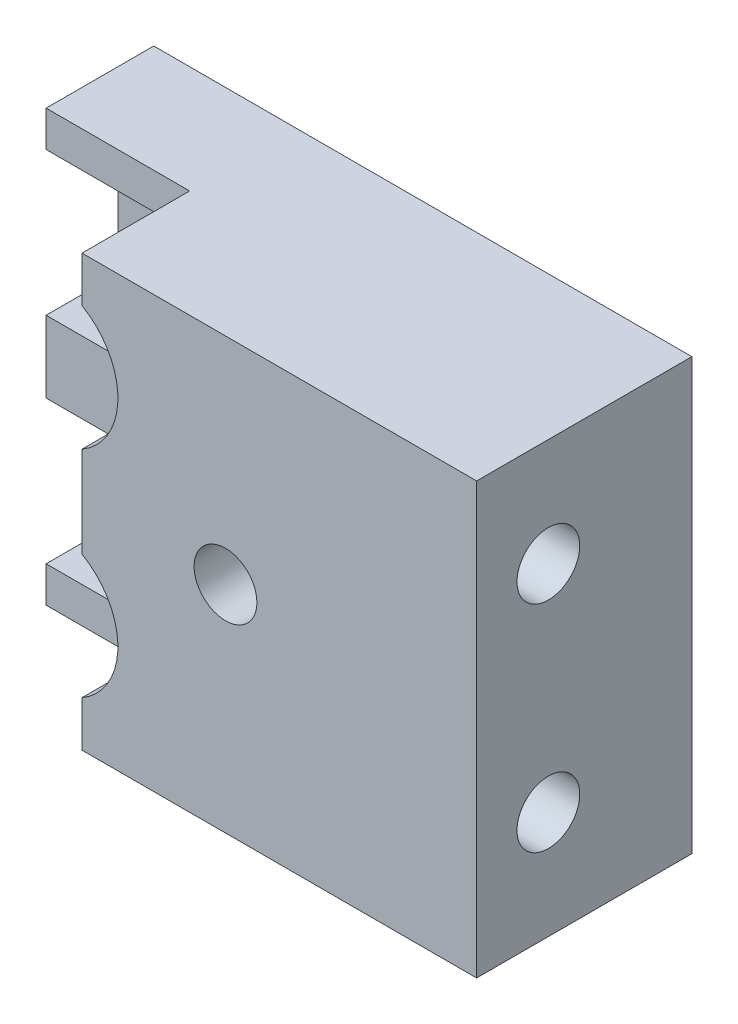
ISO-10303-21;
HEADER;
FILE_DESCRIPTION(('STEP AP214'),'2;1');
FILE_NAME('part.step','',(''),(''),'','','');
FILE_SCHEMA(('AUTOMOTIVE_DESIGN { 1 0 10303 214 1 1 1 1 }'));
ENDSEC;
DATA;
#1=APPLICATION_CONTEXT('core data for automotive mechanical design processes');
#2=APPLICATION_PROTOCOL_DEFINITION('international standard','automotive_design',2000,#1);
#3=PRODUCT_CONTEXT('',#1,'mechanical');
#4=PRODUCT('Part','Part','',(#3));
#5=PRODUCT_RELATED_PRODUCT_CATEGORY('part','',(#4));
#6=PRODUCT_DEFINITION_FORMATION('','',#4);
#7=PRODUCT_DEFINITION_CONTEXT('part definition',#1,'design');
#8=PRODUCT_DEFINITION('design','',#6,#7);
#9=PRODUCT_DEFINITION_SHAPE('','',#8);
#10=(LENGTH_UNIT() NAMED_UNIT(*) SI_UNIT(.MILLI.,.METRE.));
#11=(NAMED_UNIT(*) PLANE_ANGLE_UNIT() SI_UNIT($,.RADIAN.));
#12=(NAMED_UNIT(*) SI_UNIT($,.STERADIAN.) SOLID_ANGLE_UNIT());
#13=UNCERTAINTY_MEASURE_WITH_UNIT(LENGTH_MEASURE(1.E-05),#10,'distance_accuracy_value','');
#14=(GEOMETRIC_REPRESENTATION_CONTEXT(3) GLOBAL_UNCERTAINTY_ASSIGNED_CONTEXT((#13)) GLOBAL_UNIT_ASSIGNED_CONTEXT((#10,
#11,#12)) REPRESENTATION_CONTEXT('',''));
#15=CARTESIAN_POINT('',(0.,0.,0.));
#16=DIRECTION('',(0.,0.,1.));
#17=DIRECTION('',(1.,0.,0.));
#18=AXIS2_PLACEMENT_3D('',#15,#16,#17);
#19=CARTESIAN_POINT('',(0.,0.,60.));
#20=DIRECTION('',(1.,0.,0.));
#21=DIRECTION('',(0.,0.,-1.));
#22=AXIS2_PLACEMENT_3D('',#19,#20,#21);
#23=PLANE('',#22);
#24=DIRECTION('',(0.,-1.,0.));
#25=VECTOR('',#24,1.);
#26=CARTESIAN_POINT('',(0.,0.,30.));
#27=LINE('',#26,#25);
#28=CARTESIAN_POINT('',(0.,10.,30.));
#29=VERTEX_POINT('',#28);
#30=CARTESIAN_POINT('',(0.,0.,30.));
#31=VERTEX_POINT('',#30);
#32=EDGE_CURVE('E227',#29,#31,#27,.T.);
#33=ORIENTED_EDGE('',*,*,#32,.F.);
#34=DIRECTION('',(0.,0.,1.));
#35=VECTOR('',#34,1.);
#36=CARTESIAN_POINT('',(0.,10.,0.));
#37=LINE('',#36,#35);
#38=CARTESIAN_POINT('',(0.,10.,0.));
#39=VERTEX_POINT('',#38);
#40=EDGE_CURVE('E332',#39,#29,#37,.T.);
#41=ORIENTED_EDGE('',*,*,#40,.F.);
#42=DIRECTION('',(0.,-1.,0.));
#43=VECTOR('',#42,1.);
#44=CARTESIAN_POINT('',(0.,0.,0.));
#45=LINE('',#44,#43);
#46=CARTESIAN_POINT('',(0.,0.,0.));
#47=VERTEX_POINT('',#46);
#48=EDGE_CURVE('E357',#39,#47,#45,.T.);
#49=ORIENTED_EDGE('',*,*,#48,.T.);
#50=DIRECTION('',(0.,0.,-1.));
#51=VECTOR('',#50,1.);
#52=CARTESIAN_POINT('',(0.,0.,60.));
#53=LINE('',#52,#51);
#54=EDGE_CURVE('E11',#31,#47,#53,.T.);
#55=ORIENTED_EDGE('',*,*,#54,.F.);
#56=EDGE_LOOP('',(#33,#41,#49,#55));
#57=FACE_BOUND('',#56,.T.);
#58=ADVANCED_FACE('F35',(#57),#23,.F.);
#59=CARTESIAN_POINT('',(0.,10.,0.));
#60=DIRECTION('',(0.,-1.,0.));
#61=DIRECTION('',(0.,0.,-1.));
#62=AXIS2_PLACEMENT_3D('',#59,#60,#61);
#63=PLANE('',#62);
#64=DIRECTION('',(-1.,0.,0.));
#65=VECTOR('',#64,1.);
#66=CARTESIAN_POINT('',(0.,10.,30.));
#67=LINE('',#66,#65);
#68=CARTESIAN_POINT('',(30.,10.,30.));
#69=VERTEX_POINT('',#68);
#70=EDGE_CURVE('E225',#69,#29,#67,.T.);
#71=ORIENTED_EDGE('',*,*,#70,.F.);
#72=DIRECTION('',(0.,0.,1.));
#73=VECTOR('',#72,1.);
#74=CARTESIAN_POINT('',(30.,10.,20.));
#75=LINE('',#74,#73);
#76=CARTESIAN_POINT('',(30.,10.,20.));
#77=VERTEX_POINT('',#76);
#78=EDGE_CURVE('E298',#77,#69,#75,.T.);
#79=ORIENTED_EDGE('',*,*,#78,.F.);
#80=DIRECTION('',(1.,0.,0.));
#81=VECTOR('',#80,1.);
#82=CARTESIAN_POINT('',(10.,10.,20.));
#83=LINE('',#82,#81);
#84=CARTESIAN_POINT('',(10.,10.,20.));
#85=VERTEX_POINT('',#84);
#86=EDGE_CURVE('E292',#85,#77,#83,.T.);
#87=ORIENTED_EDGE('',*,*,#86,.F.);
#88=DIRECTION('',(0.,0.,1.));
#89=VECTOR('',#88,1.);
#90=CARTESIAN_POINT('',(10.,10.,0.));
#91=LINE('',#90,#89);
#92=CARTESIAN_POINT('',(10.,10.,0.));
#93=VERTEX_POINT('',#92);
#94=EDGE_CURVE('E340',#93,#85,#91,.T.);
#95=ORIENTED_EDGE('',*,*,#94,.F.);
#96=DIRECTION('',(1.,0.,0.));
#97=VECTOR('',#96,1.);
#98=CARTESIAN_POINT('',(0.,10.,0.));
#99=LINE('',#98,#97);
#100=EDGE_CURVE('E321',#39,#93,#99,.T.);
#101=ORIENTED_EDGE('',*,*,#100,.F.);
#102=ORIENTED_EDGE('',*,*,#40,.T.);
#103=EDGE_LOOP('',(#71,#79,#87,#95,#101,#102));
#104=FACE_BOUND('',#103,.T.);
#105=ADVANCED_FACE('F426',(#104),#63,.F.);
#106=DIRECTION('',(0.,-1.,0.));
#107=VECTOR('',#106,1.);
#108=CARTESIAN_POINT('',(0.,0.,30.));
#109=LINE('',#108,#107);
#110=CARTESIAN_POINT('',(0.,70.,30.));
#111=VERTEX_POINT('',#110);
#112=CARTESIAN_POINT('',(0.,50.,30.));
#113=VERTEX_POINT('',#112);
#114=EDGE_CURVE('E242',#111,#113,#109,.T.);
#115=ORIENTED_EDGE('',*,*,#114,.F.);
#116=DIRECTION('',(0.,0.,1.));
#117=VECTOR('',#116,1.);
#118=CARTESIAN_POINT('',(0.,70.,0.));
#119=LINE('',#118,#117);
#120=CARTESIAN_POINT('',(0.,70.,0.));
#121=VERTEX_POINT('',#120);
#122=EDGE_CURVE('E353',#121,#111,#119,.T.);
#123=ORIENTED_EDGE('',*,*,#122,.F.);
#124=CARTESIAN_POINT('',(0.,50.,0.));
#125=VERTEX_POINT('',#124);
#126=EDGE_CURVE('E379',#121,#125,#45,.T.);
#127=ORIENTED_EDGE('',*,*,#126,.T.);
#128=DIRECTION('',(0.,0.,1.));
#129=VECTOR('',#128,1.);
#130=CARTESIAN_POINT('',(0.,50.,0.));
#131=LINE('',#130,#129);
#132=EDGE_CURVE('E333',#125,#113,#131,.T.);
#133=ORIENTED_EDGE('',*,*,#132,.T.);
#134=EDGE_LOOP('',(#115,#123,#127,#133));
#135=FACE_BOUND('',#134,.T.);
#136=ADVANCED_FACE('F434',(#135),#23,.F.);
#137=CARTESIAN_POINT('',(0.,0.,60.));
#138=DIRECTION('',(0.,0.,-1.));
#139=DIRECTION('',(-1.,0.,0.));
#140=AXIS2_PLACEMENT_3D('',#137,#138,#139);
#141=PLANE('',#140);
#142=CARTESIAN_POINT('',(80.,60.,60.));
#143=DIRECTION('',(0.,0.,1.));
#144=DIRECTION('',(1.,0.,0.));
#145=AXIS2_PLACEMENT_3D('',#142,#143,#144);
#146=CIRCLE('',#145,8.74999999999999);
#147=CARTESIAN_POINT('',(88.75,60.,60.));
#148=VERTEX_POINT('',#147);
#149=EDGE_CURVE('E212',#148,#148,#146,.T.);
#150=ORIENTED_EDGE('',*,*,#149,.F.);
#151=EDGE_LOOP('',(#150));
#152=FACE_BOUND('',#151,.T.);
#153=CARTESIAN_POINT('',(30.,30.,60.));
#154=DIRECTION('',(0.,0.,1.));
#155=DIRECTION('',(-1.,0.,0.));
#156=AXIS2_PLACEMENT_3D('',#153,#154,#155);
#157=CIRCLE('',#156,20.);
#158=CARTESIAN_POINT('',(40.,12.6794919243112,60.));
#159=VERTEX_POINT('',#158);
#160=CARTESIAN_POINT('',(40.,47.3205080756888,60.));
#161=VERTEX_POINT('',#160);
#162=EDGE_CURVE('E287',#159,#161,#157,.T.);
#163=ORIENTED_EDGE('',*,*,#162,.F.);
#164=DIRECTION('',(0.,1.,0.));
#165=VECTOR('',#164,1.);
#166=CARTESIAN_POINT('',(40.,0.,60.));
#167=LINE('',#166,#165);
#168=CARTESIAN_POINT('',(40.,0.,60.));
#169=VERTEX_POINT('',#168);
#170=EDGE_CURVE('E218',#169,#159,#167,.T.);
#171=ORIENTED_EDGE('',*,*,#170,.F.);
#172=DIRECTION('',(1.,0.,0.));
#173=VECTOR('',#172,1.);
#174=CARTESIAN_POINT('',(0.,0.,60.));
#175=LINE('',#174,#173);
#176=CARTESIAN_POINT('',(150.,0.,60.));
#177=VERTEX_POINT('',#176);
#178=EDGE_CURVE('E366',#169,#177,#175,.T.);
#179=ORIENTED_EDGE('',*,*,#178,.T.);
#180=DIRECTION('',(0.,1.,0.));
#181=VECTOR('',#180,1.);
#182=CARTESIAN_POINT('',(150.,0.,60.));
#183=LINE('',#182,#181);
#184=CARTESIAN_POINT('',(150.,120.,60.));
#185=VERTEX_POINT('',#184);
#186=EDGE_CURVE('E368',#177,#185,#183,.T.);
#187=ORIENTED_EDGE('',*,*,#186,.T.);
#188=DIRECTION('',(-1.,0.,0.));
#189=VECTOR('',#188,1.);
#190=CARTESIAN_POINT('',(0.,120.,60.));
#191=LINE('',#190,#189);
#192=CARTESIAN_POINT('',(40.,120.,60.));
#193=VERTEX_POINT('',#192);
#194=EDGE_CURVE('E371',#185,#193,#191,.T.);
#195=ORIENTED_EDGE('',*,*,#194,.T.);
#196=DIRECTION('',(0.,1.,0.));
#197=VECTOR('',#196,1.);
#198=CARTESIAN_POINT('',(40.,0.,60.));
#199=LINE('',#198,#197);
#200=CARTESIAN_POINT('',(40.,107.320508075689,60.));
#201=VERTEX_POINT('',#200);
#202=EDGE_CURVE('E253',#201,#193,#199,.T.);
#203=ORIENTED_EDGE('',*,*,#202,.F.);
#204=CARTESIAN_POINT('',(30.,90.,60.));
#205=DIRECTION('',(0.,0.,1.));
#206=DIRECTION('',(-1.,0.,0.));
#207=AXIS2_PLACEMENT_3D('',#204,#205,#206);
#208=CIRCLE('',#207,20.);
#209=CARTESIAN_POINT('',(40.,72.6794919243112,60.));
#210=VERTEX_POINT('',#209);
#211=EDGE_CURVE('E303',#210,#201,#208,.T.);
#212=ORIENTED_EDGE('',*,*,#211,.F.);
#213=DIRECTION('',(0.,-1.,0.));
#214=VECTOR('',#213,1.);
#215=CARTESIAN_POINT('',(40.,0.,60.));
#216=LINE('',#215,#214);
#217=EDGE_CURVE('E234',#210,#161,#216,.T.);
#218=ORIENTED_EDGE('',*,*,#217,.T.);
#219=EDGE_LOOP('',(#163,#171,#179,#187,#195,#203,#212,#218));
#220=FACE_BOUND('',#219,.T.);
#221=ADVANCED_FACE('F411',(#152,#220),#141,.F.);
#222=CARTESIAN_POINT('',(0.,70.,0.));
#223=DIRECTION('',(0.,-1.,0.));
#224=DIRECTION('',(0.,0.,-1.));
#225=AXIS2_PLACEMENT_3D('',#222,#223,#224);
#226=PLANE('',#225);
#227=DIRECTION('',(-1.,0.,0.));
#228=VECTOR('',#227,1.);
#229=CARTESIAN_POINT('',(0.,70.,30.));
#230=LINE('',#229,#228);
#231=CARTESIAN_POINT('',(30.,70.,30.));
#232=VERTEX_POINT('',#231);
#233=EDGE_CURVE('E240',#232,#111,#230,.T.);
#234=ORIENTED_EDGE('',*,*,#233,.F.);
#235=DIRECTION('',(0.,0.,1.));
#236=VECTOR('',#235,1.);
#237=CARTESIAN_POINT('',(30.,70.,20.));
#238=LINE('',#237,#236);
#239=CARTESIAN_POINT('',(30.,70.,20.));
#240=VERTEX_POINT('',#239);
#241=EDGE_CURVE('E316',#240,#232,#238,.T.);
#242=ORIENTED_EDGE('',*,*,#241,.F.);
#243=DIRECTION('',(1.,0.,0.));
#244=VECTOR('',#243,1.);
#245=CARTESIAN_POINT('',(10.,70.,20.));
#246=LINE('',#245,#244);
#247=CARTESIAN_POINT('',(10.,70.,20.));
#248=VERTEX_POINT('',#247);
#249=EDGE_CURVE('E308',#248,#240,#246,.T.);
#250=ORIENTED_EDGE('',*,*,#249,.F.);
#251=DIRECTION('',(0.,0.,1.));
#252=VECTOR('',#251,1.);
#253=CARTESIAN_POINT('',(10.,70.,0.));
#254=LINE('',#253,#252);
#255=CARTESIAN_POINT('',(10.,70.,0.));
#256=VERTEX_POINT('',#255);
#257=EDGE_CURVE('E361',#256,#248,#254,.T.);
#258=ORIENTED_EDGE('',*,*,#257,.F.);
#259=DIRECTION('',(1.,0.,0.));
#260=VECTOR('',#259,1.);
#261=CARTESIAN_POINT('',(0.,70.,0.));
#262=LINE('',#261,#260);
#263=EDGE_CURVE('E336',#121,#256,#262,.T.);
#264=ORIENTED_EDGE('',*,*,#263,.F.);
#265=ORIENTED_EDGE('',*,*,#122,.T.);
#266=EDGE_LOOP('',(#234,#242,#250,#258,#264,#265));
#267=FACE_BOUND('',#266,.T.);
#268=ADVANCED_FACE('F453',(#267),#226,.F.);
#269=CARTESIAN_POINT('',(0.,50.,0.));
#270=DIRECTION('',(0.,1.,0.));
#271=DIRECTION('',(0.,0.,1.));
#272=AXIS2_PLACEMENT_3D('',#269,#270,#271);
#273=PLANE('',#272);
#274=DIRECTION('',(1.,0.,0.));
#275=VECTOR('',#274,1.);
#276=CARTESIAN_POINT('',(0.,50.,30.));
#277=LINE('',#276,#275);
#278=CARTESIAN_POINT('',(30.,50.,30.));
#279=VERTEX_POINT('',#278);
#280=EDGE_CURVE('E57',#113,#279,#277,.T.);
#281=ORIENTED_EDGE('',*,*,#280,.F.);
#282=ORIENTED_EDGE('',*,*,#132,.F.);
#283=DIRECTION('',(-1.,0.,0.));
#284=VECTOR('',#283,1.);
#285=CARTESIAN_POINT('',(0.,50.,0.));
#286=LINE('',#285,#284);
#287=CARTESIAN_POINT('',(10.,50.,0.));
#288=VERTEX_POINT('',#287);
#289=EDGE_CURVE('E329',#288,#125,#286,.T.);
#290=ORIENTED_EDGE('',*,*,#289,.F.);
#291=DIRECTION('',(0.,0.,1.));
#292=VECTOR('',#291,1.);
#293=CARTESIAN_POINT('',(10.,50.,0.));
#294=LINE('',#293,#292);
#295=CARTESIAN_POINT('',(10.,50.,20.));
#296=VERTEX_POINT('',#295);
#297=EDGE_CURVE('E337',#288,#296,#294,.T.);
#298=ORIENTED_EDGE('',*,*,#297,.T.);
#299=DIRECTION('',(-1.,0.,0.));
#300=VECTOR('',#299,1.);
#301=CARTESIAN_POINT('',(10.,50.,20.));
#302=LINE('',#301,#300);
#303=CARTESIAN_POINT('',(30.,50.,20.));
#304=VERTEX_POINT('',#303);
#305=EDGE_CURVE('E288',#304,#296,#302,.T.);
#306=ORIENTED_EDGE('',*,*,#305,.F.);
#307=DIRECTION('',(0.,0.,1.));
#308=VECTOR('',#307,1.);
#309=CARTESIAN_POINT('',(30.,50.,20.));
#310=LINE('',#309,#308);
#311=EDGE_CURVE('E300',#304,#279,#310,.T.);
#312=ORIENTED_EDGE('',*,*,#311,.T.);
#313=EDGE_LOOP('',(#281,#282,#290,#298,#306,#312));
#314=FACE_BOUND('',#313,.T.);
#315=ADVANCED_FACE('F437',(#314),#273,.F.);
#316=CARTESIAN_POINT('',(30.,90.,20.));
#317=DIRECTION('',(0.,0.,1.));
#318=DIRECTION('',(1.,0.,0.));
#319=AXIS2_PLACEMENT_3D('',#316,#317,#318);
#320=CYLINDRICAL_SURFACE('',#319,20.);
#321=DIRECTION('',(0.,0.,1.));
#322=VECTOR('',#321,1.);
#323=CARTESIAN_POINT('',(40.,72.6794919243112,30.));
#324=LINE('',#323,#322);
#325=CARTESIAN_POINT('',(40.,72.6794919243112,30.));
#326=VERTEX_POINT('',#325);
#327=EDGE_CURVE('E247',#326,#210,#324,.T.);
#328=ORIENTED_EDGE('',*,*,#327,.T.);
#329=ORIENTED_EDGE('',*,*,#211,.T.);
#330=DIRECTION('',(0.,0.,1.));
#331=VECTOR('',#330,1.);
#332=CARTESIAN_POINT('',(40.,107.320508075689,30.));
#333=LINE('',#332,#331);
#334=CARTESIAN_POINT('',(40.,107.320508075689,30.));
#335=VERTEX_POINT('',#334);
#336=EDGE_CURVE('E268',#335,#201,#333,.T.);
#337=ORIENTED_EDGE('',*,*,#336,.F.);
#338=CARTESIAN_POINT('',(30.,90.,30.));
#339=DIRECTION('',(0.,0.,1.));
#340=DIRECTION('',(1.,0.,0.));
#341=AXIS2_PLACEMENT_3D('',#338,#339,#340);
#342=CIRCLE('',#341,20.);
#343=CARTESIAN_POINT('',(30.,110.,30.));
#344=VERTEX_POINT('',#343);
#345=EDGE_CURVE('E256',#344,#335,#342,.F.);
#346=ORIENTED_EDGE('',*,*,#345,.F.);
#347=DIRECTION('',(0.,0.,1.));
#348=VECTOR('',#347,1.);
#349=CARTESIAN_POINT('',(30.,110.,20.));
#350=LINE('',#349,#348);
#351=CARTESIAN_POINT('',(30.,110.,20.));
#352=VERTEX_POINT('',#351);
#353=EDGE_CURVE('E318',#352,#344,#350,.T.);
#354=ORIENTED_EDGE('',*,*,#353,.F.);
#355=CARTESIAN_POINT('',(30.,90.,20.));
#356=DIRECTION('',(0.,0.,1.));
#357=DIRECTION('',(-1.,0.,0.));
#358=AXIS2_PLACEMENT_3D('',#355,#356,#357);
#359=CIRCLE('',#358,20.);
#360=EDGE_CURVE('E311',#240,#352,#359,.T.);
#361=ORIENTED_EDGE('',*,*,#360,.F.);
#362=ORIENTED_EDGE('',*,*,#241,.T.);
#363=CARTESIAN_POINT('',(30.,90.,30.));
#364=DIRECTION('',(0.,0.,1.));
#365=DIRECTION('',(1.,0.,0.));
#366=AXIS2_PLACEMENT_3D('',#363,#364,#365);
#367=CIRCLE('',#366,20.);
#368=EDGE_CURVE('E238',#326,#232,#367,.F.);
#369=ORIENTED_EDGE('',*,*,#368,.F.);
#370=EDGE_LOOP('',(#328,#329,#337,#346,#354,#361,#362,#369));
#371=FACE_BOUND('',#370,.T.);
#372=ADVANCED_FACE('F449',(#371),#320,.F.);
#373=CARTESIAN_POINT('',(30.,30.,20.));
#374=DIRECTION('',(0.,0.,1.));
#375=DIRECTION('',(1.,0.,0.));
#376=AXIS2_PLACEMENT_3D('',#373,#374,#375);
#377=CYLINDRICAL_SURFACE('',#376,20.);
#378=CARTESIAN_POINT('',(30.,30.,30.));
#379=DIRECTION('',(0.,0.,1.));
#380=DIRECTION('',(1.,0.,0.));
#381=AXIS2_PLACEMENT_3D('',#378,#379,#380);
#382=CIRCLE('',#381,20.);
#383=CARTESIAN_POINT('',(40.,12.6794919243112,30.));
#384=VERTEX_POINT('',#383);
#385=EDGE_CURVE('E49',#384,#69,#382,.F.);
#386=ORIENTED_EDGE('',*,*,#385,.F.);
#387=DIRECTION('',(0.,0.,1.));
#388=VECTOR('',#387,1.);
#389=CARTESIAN_POINT('',(40.,12.6794919243112,30.));
#390=LINE('',#389,#388);
#391=EDGE_CURVE('E231',#384,#159,#390,.T.);
#392=ORIENTED_EDGE('',*,*,#391,.T.);
#393=ORIENTED_EDGE('',*,*,#162,.T.);
#394=DIRECTION('',(0.,0.,1.));
#395=VECTOR('',#394,1.);
#396=CARTESIAN_POINT('',(40.,47.3205080756888,30.));
#397=LINE('',#396,#395);
#398=CARTESIAN_POINT('',(40.,47.3205080756888,30.));
#399=VERTEX_POINT('',#398);
#400=EDGE_CURVE('E250',#399,#161,#397,.T.);
#401=ORIENTED_EDGE('',*,*,#400,.F.);
#402=CARTESIAN_POINT('',(30.,30.,30.));
#403=DIRECTION('',(0.,0.,1.));
#404=DIRECTION('',(1.,0.,0.));
#405=AXIS2_PLACEMENT_3D('',#402,#403,#404);
#406=CIRCLE('',#405,20.);
#407=EDGE_CURVE('E245',#279,#399,#406,.F.);
#408=ORIENTED_EDGE('',*,*,#407,.F.);
#409=ORIENTED_EDGE('',*,*,#311,.F.);
#410=CARTESIAN_POINT('',(30.,30.,20.));
#411=DIRECTION('',(0.,0.,1.));
#412=DIRECTION('',(-1.,0.,0.));
#413=AXIS2_PLACEMENT_3D('',#410,#411,#412);
#414=CIRCLE('',#413,20.);
#415=EDGE_CURVE('E295',#77,#304,#414,.T.);
#416=ORIENTED_EDGE('',*,*,#415,.F.);
#417=ORIENTED_EDGE('',*,*,#78,.T.);
#418=EDGE_LOOP('',(#386,#392,#393,#401,#408,#409,#416,#417));
#419=FACE_BOUND('',#418,.T.);
#420=ADVANCED_FACE('F441',(#419),#377,.F.);
#421=DIRECTION('',(0.,-1.,0.));
#422=VECTOR('',#421,1.);
#423=CARTESIAN_POINT('',(0.,0.,30.));
#424=LINE('',#423,#422);
#425=CARTESIAN_POINT('',(0.,120.,30.));
#426=VERTEX_POINT('',#425);
#427=CARTESIAN_POINT('',(0.,110.,30.));
#428=VERTEX_POINT('',#427);
#429=EDGE_CURVE('E264',#426,#428,#424,.T.);
#430=ORIENTED_EDGE('',*,*,#429,.F.);
#431=DIRECTION('',(0.,0.,-1.));
#432=VECTOR('',#431,1.);
#433=CARTESIAN_POINT('',(0.,120.,60.));
#434=LINE('',#433,#432);
#435=CARTESIAN_POINT('',(0.,120.,0.));
#436=VERTEX_POINT('',#435);
#437=EDGE_CURVE('E374',#426,#436,#434,.T.);
#438=ORIENTED_EDGE('',*,*,#437,.T.);
#439=CARTESIAN_POINT('',(0.,110.,0.));
#440=VERTEX_POINT('',#439);
#441=EDGE_CURVE('E375',#436,#440,#45,.T.);
#442=ORIENTED_EDGE('',*,*,#441,.T.);
#443=DIRECTION('',(0.,0.,1.));
#444=VECTOR('',#443,1.);
#445=CARTESIAN_POINT('',(0.,110.,0.));
#446=LINE('',#445,#444);
#447=EDGE_CURVE('E354',#440,#428,#446,.T.);
#448=ORIENTED_EDGE('',*,*,#447,.T.);
#449=EDGE_LOOP('',(#430,#438,#442,#448));
#450=FACE_BOUND('',#449,.T.);
#451=ADVANCED_FACE('F462',(#450),#23,.F.);
#452=CARTESIAN_POINT('',(0.,110.,0.));
#453=DIRECTION('',(0.,1.,0.));
#454=DIRECTION('',(0.,0.,1.));
#455=AXIS2_PLACEMENT_3D('',#452,#453,#454);
#456=PLANE('',#455);
#457=DIRECTION('',(1.,0.,0.));
#458=VECTOR('',#457,1.);
#459=CARTESIAN_POINT('',(0.,110.,30.));
#460=LINE('',#459,#458);
#461=EDGE_CURVE('E266',#428,#344,#460,.T.);
#462=ORIENTED_EDGE('',*,*,#461,.F.);
#463=ORIENTED_EDGE('',*,*,#447,.F.);
#464=DIRECTION('',(-1.,0.,0.));
#465=VECTOR('',#464,1.);
#466=CARTESIAN_POINT('',(0.,110.,0.));
#467=LINE('',#466,#465);
#468=CARTESIAN_POINT('',(10.,110.,0.));
#469=VERTEX_POINT('',#468);
#470=EDGE_CURVE('E350',#469,#440,#467,.T.);
#471=ORIENTED_EDGE('',*,*,#470,.F.);
#472=DIRECTION('',(0.,0.,1.));
#473=VECTOR('',#472,1.);
#474=CARTESIAN_POINT('',(10.,110.,0.));
#475=LINE('',#474,#473);
#476=CARTESIAN_POINT('',(10.,110.,20.));
#477=VERTEX_POINT('',#476);
#478=EDGE_CURVE('E358',#469,#477,#475,.T.);
#479=ORIENTED_EDGE('',*,*,#478,.T.);
#480=DIRECTION('',(-1.,0.,0.));
#481=VECTOR('',#480,1.);
#482=CARTESIAN_POINT('',(10.,110.,20.));
#483=LINE('',#482,#481);
#484=EDGE_CURVE('E314',#352,#477,#483,.T.);
#485=ORIENTED_EDGE('',*,*,#484,.F.);
#486=ORIENTED_EDGE('',*,*,#353,.T.);
#487=EDGE_LOOP('',(#462,#463,#471,#479,#485,#486));
#488=FACE_BOUND('',#487,.T.);
#489=ADVANCED_FACE('F467',(#488),#456,.F.);
#490=CARTESIAN_POINT('',(0.,0.,60.));
#491=DIRECTION('',(0.,1.,0.));
#492=DIRECTION('',(0.,0.,1.));
#493=AXIS2_PLACEMENT_3D('',#490,#491,#492);
#494=PLANE('',#493);
#495=ORIENTED_EDGE('',*,*,#178,.F.);
#496=DIRECTION('',(0.,0.,1.));
#497=VECTOR('',#496,1.);
#498=CARTESIAN_POINT('',(40.,0.,30.));
#499=LINE('',#498,#497);
#500=CARTESIAN_POINT('',(40.,0.,30.));
#501=VERTEX_POINT('',#500);
#502=EDGE_CURVE('E229',#501,#169,#499,.T.);
#503=ORIENTED_EDGE('',*,*,#502,.F.);
#504=DIRECTION('',(1.,0.,0.));
#505=VECTOR('',#504,1.);
#506=CARTESIAN_POINT('',(0.,0.,30.));
#507=LINE('',#506,#505);
#508=EDGE_CURVE('E219',#31,#501,#507,.T.);
#509=ORIENTED_EDGE('',*,*,#508,.F.);
#510=ORIENTED_EDGE('',*,*,#54,.T.);
#511=DIRECTION('',(1.,0.,0.));
#512=VECTOR('',#511,1.);
#513=CARTESIAN_POINT('',(0.,0.,0.));
#514=LINE('',#513,#512);
#515=CARTESIAN_POINT('',(150.,0.,0.));
#516=VERTEX_POINT('',#515);
#517=EDGE_CURVE('E378',#47,#516,#514,.T.);
#518=ORIENTED_EDGE('',*,*,#517,.T.);
#519=DIRECTION('',(0.,0.,-1.));
#520=VECTOR('',#519,1.);
#521=CARTESIAN_POINT('',(150.,0.,60.));
#522=LINE('',#521,#520);
#523=EDGE_CURVE('E42',#177,#516,#522,.T.);
#524=ORIENTED_EDGE('',*,*,#523,.F.);
#525=EDGE_LOOP('',(#495,#503,#509,#510,#518,#524));
#526=FACE_BOUND('',#525,.T.);
#527=ADVANCED_FACE('F415',(#526),#494,.F.);
#528=CARTESIAN_POINT('',(150.,0.,60.));
#529=DIRECTION('',(-1.,0.,0.));
#530=DIRECTION('',(0.,0.,1.));
#531=AXIS2_PLACEMENT_3D('',#528,#529,#530);
#532=PLANE('',#531);
#533=CARTESIAN_POINT('',(150.,90.,40.));
#534=DIRECTION('',(1.,0.,0.));
#535=DIRECTION('',(0.,0.,-1.));
#536=AXIS2_PLACEMENT_3D('',#533,#534,#535);
#537=CIRCLE('',#536,8.74999999999998);
#538=CARTESIAN_POINT('',(150.,90.,31.25));
#539=VERTEX_POINT('',#538);
#540=EDGE_CURVE('E202',#539,#539,#537,.T.);
#541=ORIENTED_EDGE('',*,*,#540,.F.);
#542=EDGE_LOOP('',(#541));
#543=FACE_BOUND('',#542,.T.);
#544=CARTESIAN_POINT('',(150.,30.,40.));
#545=DIRECTION('',(1.,0.,0.));
#546=DIRECTION('',(0.,0.,-1.));
#547=AXIS2_PLACEMENT_3D('',#544,#545,#546);
#548=CIRCLE('',#547,8.74999999999999);
#549=CARTESIAN_POINT('',(150.,30.,31.25));
#550=VERTEX_POINT('',#549);
#551=EDGE_CURVE('E201',#550,#550,#548,.T.);
#552=ORIENTED_EDGE('',*,*,#551,.F.);
#553=EDGE_LOOP('',(#552));
#554=FACE_BOUND('',#553,.T.);
#555=DIRECTION('',(0.,1.,0.));
#556=VECTOR('',#555,1.);
#557=CARTESIAN_POINT('',(150.,0.,0.));
#558=LINE('',#557,#556);
#559=CARTESIAN_POINT('',(150.,120.,0.));
#560=VERTEX_POINT('',#559);
#561=EDGE_CURVE('E381',#516,#560,#558,.T.);
#562=ORIENTED_EDGE('',*,*,#561,.T.);
#563=DIRECTION('',(0.,0.,-1.));
#564=VECTOR('',#563,1.);
#565=CARTESIAN_POINT('',(150.,120.,60.));
#566=LINE('',#565,#564);
#567=EDGE_CURVE('E386',#185,#560,#566,.T.);
#568=ORIENTED_EDGE('',*,*,#567,.F.);
#569=ORIENTED_EDGE('',*,*,#186,.F.);
#570=ORIENTED_EDGE('',*,*,#523,.T.);
#571=EDGE_LOOP('',(#562,#568,#569,#570));
#572=FACE_BOUND('',#571,.T.);
#573=ADVANCED_FACE('F393',(#543,#554,#572),#532,.F.);
#574=CARTESIAN_POINT('',(0.,120.,60.));
#575=DIRECTION('',(0.,-1.,0.));
#576=DIRECTION('',(0.,0.,-1.));
#577=AXIS2_PLACEMENT_3D('',#574,#575,#576);
#578=PLANE('',#577);
#579=DIRECTION('',(-1.,0.,0.));
#580=VECTOR('',#579,1.);
#581=CARTESIAN_POINT('',(0.,120.,30.));
#582=LINE('',#581,#580);
#583=CARTESIAN_POINT('',(40.,120.,30.));
#584=VERTEX_POINT('',#583);
#585=EDGE_CURVE('E262',#584,#426,#582,.T.);
#586=ORIENTED_EDGE('',*,*,#585,.F.);
#587=DIRECTION('',(0.,0.,1.));
#588=VECTOR('',#587,1.);
#589=CARTESIAN_POINT('',(40.,120.,30.));
#590=LINE('',#589,#588);
#591=EDGE_CURVE('E270',#584,#193,#590,.T.);
#592=ORIENTED_EDGE('',*,*,#591,.T.);
#593=ORIENTED_EDGE('',*,*,#194,.F.);
#594=ORIENTED_EDGE('',*,*,#567,.T.);
#595=DIRECTION('',(-1.,0.,0.));
#596=VECTOR('',#595,1.);
#597=CARTESIAN_POINT('',(0.,120.,0.));
#598=LINE('',#597,#596);
#599=EDGE_CURVE('E369',#560,#436,#598,.T.);
#600=ORIENTED_EDGE('',*,*,#599,.T.);
#601=ORIENTED_EDGE('',*,*,#437,.F.);
#602=EDGE_LOOP('',(#586,#592,#593,#594,#600,#601));
#603=FACE_BOUND('',#602,.T.);
#604=ADVANCED_FACE('F406',(#603),#578,.F.);
#605=CARTESIAN_POINT('',(0.,0.,0.));
#606=DIRECTION('',(0.,0.,-1.));
#607=DIRECTION('',(-1.,0.,0.));
#608=AXIS2_PLACEMENT_3D('',#605,#606,#607);
#609=PLANE('',#608);
#610=CARTESIAN_POINT('',(30.,90.,0.));
#611=DIRECTION('',(0.,0.,-1.));
#612=DIRECTION('',(-1.,0.,0.));
#613=AXIS2_PLACEMENT_3D('',#610,#611,#612);
#614=CIRCLE('',#613,8.74999999999998);
#615=CARTESIAN_POINT('',(21.25,90.,0.));
#616=VERTEX_POINT('',#615);
#617=EDGE_CURVE('E278',#616,#616,#614,.T.);
#618=ORIENTED_EDGE('',*,*,#617,.F.);
#619=EDGE_LOOP('',(#618));
#620=FACE_BOUND('',#619,.T.);
#621=CARTESIAN_POINT('',(30.,30.,0.));
#622=DIRECTION('',(0.,0.,-1.));
#623=DIRECTION('',(-1.,0.,0.));
#624=AXIS2_PLACEMENT_3D('',#621,#622,#623);
#625=CIRCLE('',#624,8.74999999999998);
#626=CARTESIAN_POINT('',(21.25,30.,0.));
#627=VERTEX_POINT('',#626);
#628=EDGE_CURVE('E284',#627,#627,#625,.T.);
#629=ORIENTED_EDGE('',*,*,#628,.F.);
#630=EDGE_LOOP('',(#629));
#631=FACE_BOUND('',#630,.T.);
#632=ORIENTED_EDGE('',*,*,#289,.T.);
#633=ORIENTED_EDGE('',*,*,#126,.F.);
#634=ORIENTED_EDGE('',*,*,#263,.T.);
#635=DIRECTION('',(0.,1.,0.));
#636=VECTOR('',#635,1.);
#637=CARTESIAN_POINT('',(10.,110.,0.));
#638=LINE('',#637,#636);
#639=EDGE_CURVE('E347',#256,#469,#638,.T.);
#640=ORIENTED_EDGE('',*,*,#639,.T.);
#641=ORIENTED_EDGE('',*,*,#470,.T.);
#642=ORIENTED_EDGE('',*,*,#441,.F.);
#643=ORIENTED_EDGE('',*,*,#599,.F.);
#644=ORIENTED_EDGE('',*,*,#561,.F.);
#645=ORIENTED_EDGE('',*,*,#517,.F.);
#646=ORIENTED_EDGE('',*,*,#48,.F.);
#647=ORIENTED_EDGE('',*,*,#100,.T.);
#648=DIRECTION('',(0.,1.,0.));
#649=VECTOR('',#648,1.);
#650=CARTESIAN_POINT('',(10.,50.,0.));
#651=LINE('',#650,#649);
#652=EDGE_CURVE('E326',#93,#288,#651,.T.);
#653=ORIENTED_EDGE('',*,*,#652,.T.);
#654=EDGE_LOOP('',(#632,#633,#634,#640,#641,#642,#643,#644,#645,#646,#647,#653));
#655=FACE_BOUND('',#654,.T.);
#656=ADVANCED_FACE('F400',(#620,#631,#655),#609,.T.);
#657=CARTESIAN_POINT('',(10.,110.,0.));
#658=DIRECTION('',(1.,0.,0.));
#659=DIRECTION('',(0.,1.,0.));
#660=AXIS2_PLACEMENT_3D('',#657,#658,#659);
#661=PLANE('',#660);
#662=ORIENTED_EDGE('',*,*,#257,.T.);
#663=DIRECTION('',(0.,-1.,0.));
#664=VECTOR('',#663,1.);
#665=CARTESIAN_POINT('',(10.,70.,20.));
#666=LINE('',#665,#664);
#667=EDGE_CURVE('E306',#477,#248,#666,.T.);
#668=ORIENTED_EDGE('',*,*,#667,.F.);
#669=ORIENTED_EDGE('',*,*,#478,.F.);
#670=ORIENTED_EDGE('',*,*,#639,.F.);
#671=EDGE_LOOP('',(#662,#668,#669,#670));
#672=FACE_BOUND('',#671,.T.);
#673=ADVANCED_FACE('F457',(#672),#661,.F.);
#674=CARTESIAN_POINT('',(10.,50.,0.));
#675=DIRECTION('',(1.,0.,0.));
#676=DIRECTION('',(0.,1.,0.));
#677=AXIS2_PLACEMENT_3D('',#674,#675,#676);
#678=PLANE('',#677);
#679=ORIENTED_EDGE('',*,*,#94,.T.);
#680=DIRECTION('',(0.,-1.,0.));
#681=VECTOR('',#680,1.);
#682=CARTESIAN_POINT('',(10.,50.,20.));
#683=LINE('',#682,#681);
#684=EDGE_CURVE('E290',#296,#85,#683,.T.);
#685=ORIENTED_EDGE('',*,*,#684,.F.);
#686=ORIENTED_EDGE('',*,*,#297,.F.);
#687=ORIENTED_EDGE('',*,*,#652,.F.);
#688=EDGE_LOOP('',(#679,#685,#686,#687));
#689=FACE_BOUND('',#688,.T.);
#690=ADVANCED_FACE('F474',(#689),#678,.F.);
#691=CARTESIAN_POINT('',(30.,90.,20.));
#692=DIRECTION('',(0.,0.,-1.));
#693=DIRECTION('',(-1.,0.,0.));
#694=AXIS2_PLACEMENT_3D('',#691,#692,#693);
#695=PLANE('',#694);
#696=CARTESIAN_POINT('',(30.,90.,20.));
#697=DIRECTION('',(0.,0.,1.));
#698=DIRECTION('',(1.,0.,0.));
#699=AXIS2_PLACEMENT_3D('',#696,#697,#698);
#700=CIRCLE('',#699,8.74999999999999);
#701=CARTESIAN_POINT('',(38.75,90.,20.));
#702=VERTEX_POINT('',#701);
#703=EDGE_CURVE('E273',#702,#702,#700,.T.);
#704=ORIENTED_EDGE('',*,*,#703,.F.);
#705=EDGE_LOOP('',(#704));
#706=FACE_BOUND('',#705,.T.);
#707=ORIENTED_EDGE('',*,*,#667,.T.);
#708=ORIENTED_EDGE('',*,*,#249,.T.);
#709=ORIENTED_EDGE('',*,*,#360,.T.);
#710=ORIENTED_EDGE('',*,*,#484,.T.);
#711=EDGE_LOOP('',(#707,#708,#709,#710));
#712=FACE_BOUND('',#711,.T.);
#713=ADVANCED_FACE('F471',(#706,#712),#695,.F.);
#714=CARTESIAN_POINT('',(30.,30.,20.));
#715=DIRECTION('',(0.,0.,-1.));
#716=DIRECTION('',(-1.,0.,0.));
#717=AXIS2_PLACEMENT_3D('',#714,#715,#716);
#718=PLANE('',#717);
#719=CARTESIAN_POINT('',(30.,30.,20.));
#720=DIRECTION('',(0.,0.,1.));
#721=DIRECTION('',(1.,0.,0.));
#722=AXIS2_PLACEMENT_3D('',#719,#720,#721);
#723=CIRCLE('',#722,8.74999999999999);
#724=CARTESIAN_POINT('',(38.75,30.,20.));
#725=VERTEX_POINT('',#724);
#726=EDGE_CURVE('E281',#725,#725,#723,.T.);
#727=ORIENTED_EDGE('',*,*,#726,.F.);
#728=EDGE_LOOP('',(#727));
#729=FACE_BOUND('',#728,.T.);
#730=ORIENTED_EDGE('',*,*,#305,.T.);
#731=ORIENTED_EDGE('',*,*,#684,.T.);
#732=ORIENTED_EDGE('',*,*,#86,.T.);
#733=ORIENTED_EDGE('',*,*,#415,.T.);
#734=EDGE_LOOP('',(#730,#731,#732,#733));
#735=FACE_BOUND('',#734,.T.);
#736=ADVANCED_FACE('F473',(#729,#735),#718,.F.);
#737=CARTESIAN_POINT('',(30.,30.,20.));
#738=DIRECTION('',(0.,0.,1.));
#739=DIRECTION('',(1.,0.,0.));
#740=AXIS2_PLACEMENT_3D('',#737,#738,#739);
#741=CYLINDRICAL_SURFACE('',#740,8.74999999999998);
#742=ORIENTED_EDGE('',*,*,#628,.T.);
#743=EDGE_LOOP('',(#742));
#744=FACE_BOUND('',#743,.T.);
#745=ORIENTED_EDGE('',*,*,#726,.T.);
#746=EDGE_LOOP('',(#745));
#747=FACE_BOUND('',#746,.T.);
#748=ADVANCED_FACE('F481',(#744,#747),#741,.F.);
#749=CARTESIAN_POINT('',(30.,90.,20.));
#750=DIRECTION('',(0.,0.,1.));
#751=DIRECTION('',(1.,0.,0.));
#752=AXIS2_PLACEMENT_3D('',#749,#750,#751);
#753=CYLINDRICAL_SURFACE('',#752,8.74999999999998);
#754=ORIENTED_EDGE('',*,*,#617,.T.);
#755=EDGE_LOOP('',(#754));
#756=FACE_BOUND('',#755,.T.);
#757=ORIENTED_EDGE('',*,*,#703,.T.);
#758=EDGE_LOOP('',(#757));
#759=FACE_BOUND('',#758,.T.);
#760=ADVANCED_FACE('F507',(#756,#759),#753,.F.);
#761=CARTESIAN_POINT('',(40.,0.,30.));
#762=DIRECTION('',(1.,0.,0.));
#763=DIRECTION('',(0.,0.,-1.));
#764=AXIS2_PLACEMENT_3D('',#761,#762,#763);
#765=PLANE('',#764);
#766=ORIENTED_EDGE('',*,*,#202,.T.);
#767=ORIENTED_EDGE('',*,*,#591,.F.);
#768=DIRECTION('',(0.,1.,0.));
#769=VECTOR('',#768,1.);
#770=CARTESIAN_POINT('',(40.,0.,30.));
#771=LINE('',#770,#769);
#772=EDGE_CURVE('E259',#335,#584,#771,.T.);
#773=ORIENTED_EDGE('',*,*,#772,.F.);
#774=ORIENTED_EDGE('',*,*,#336,.T.);
#775=EDGE_LOOP('',(#766,#767,#773,#774));
#776=FACE_BOUND('',#775,.T.);
#777=ADVANCED_FACE('F511',(#776),#765,.F.);
#778=CARTESIAN_POINT('',(0.,0.,30.));
#779=DIRECTION('',(0.,0.,1.));
#780=DIRECTION('',(1.,0.,0.));
#781=AXIS2_PLACEMENT_3D('',#778,#779,#780);
#782=PLANE('',#781);
#783=ORIENTED_EDGE('',*,*,#345,.T.);
#784=ORIENTED_EDGE('',*,*,#772,.T.);
#785=ORIENTED_EDGE('',*,*,#585,.T.);
#786=ORIENTED_EDGE('',*,*,#429,.T.);
#787=ORIENTED_EDGE('',*,*,#461,.T.);
#788=EDGE_LOOP('',(#783,#784,#785,#786,#787));
#789=FACE_BOUND('',#788,.T.);
#790=ADVANCED_FACE('F465',(#789),#782,.T.);
#791=CARTESIAN_POINT('',(40.,0.,30.));
#792=DIRECTION('',(-1.,0.,0.));
#793=DIRECTION('',(0.,0.,1.));
#794=AXIS2_PLACEMENT_3D('',#791,#792,#793);
#795=PLANE('',#794);
#796=ORIENTED_EDGE('',*,*,#217,.F.);
#797=ORIENTED_EDGE('',*,*,#327,.F.);
#798=DIRECTION('',(0.,-1.,0.));
#799=VECTOR('',#798,1.);
#800=CARTESIAN_POINT('',(40.,0.,30.));
#801=LINE('',#800,#799);
#802=EDGE_CURVE('E236',#326,#399,#801,.T.);
#803=ORIENTED_EDGE('',*,*,#802,.T.);
#804=ORIENTED_EDGE('',*,*,#400,.T.);
#805=EDGE_LOOP('',(#796,#797,#803,#804));
#806=FACE_BOUND('',#805,.T.);
#807=ADVANCED_FACE('F518',(#806),#795,.T.);
#808=CARTESIAN_POINT('',(0.,0.,30.));
#809=DIRECTION('',(0.,0.,1.));
#810=DIRECTION('',(1.,0.,0.));
#811=AXIS2_PLACEMENT_3D('',#808,#809,#810);
#812=PLANE('',#811);
#813=ORIENTED_EDGE('',*,*,#802,.F.);
#814=ORIENTED_EDGE('',*,*,#368,.T.);
#815=ORIENTED_EDGE('',*,*,#233,.T.);
#816=ORIENTED_EDGE('',*,*,#114,.T.);
#817=ORIENTED_EDGE('',*,*,#280,.T.);
#818=ORIENTED_EDGE('',*,*,#407,.T.);
#819=EDGE_LOOP('',(#813,#814,#815,#816,#817,#818));
#820=FACE_BOUND('',#819,.T.);
#821=ADVANCED_FACE('F444',(#820),#812,.T.);
#822=CARTESIAN_POINT('',(40.,0.,30.));
#823=DIRECTION('',(1.,0.,0.));
#824=DIRECTION('',(0.,0.,-1.));
#825=AXIS2_PLACEMENT_3D('',#822,#823,#824);
#826=PLANE('',#825);
#827=ORIENTED_EDGE('',*,*,#170,.T.);
#828=ORIENTED_EDGE('',*,*,#391,.F.);
#829=DIRECTION('',(0.,1.,0.));
#830=VECTOR('',#829,1.);
#831=CARTESIAN_POINT('',(40.,0.,30.));
#832=LINE('',#831,#830);
#833=EDGE_CURVE('E222',#501,#384,#832,.T.);
#834=ORIENTED_EDGE('',*,*,#833,.F.);
#835=ORIENTED_EDGE('',*,*,#502,.T.);
#836=EDGE_LOOP('',(#827,#828,#834,#835));
#837=FACE_BOUND('',#836,.T.);
#838=ADVANCED_FACE('F419',(#837),#826,.F.);
#839=CARTESIAN_POINT('',(0.,0.,30.));
#840=DIRECTION('',(0.,0.,1.));
#841=DIRECTION('',(1.,0.,0.));
#842=AXIS2_PLACEMENT_3D('',#839,#840,#841);
#843=PLANE('',#842);
#844=ORIENTED_EDGE('',*,*,#508,.T.);
#845=ORIENTED_EDGE('',*,*,#833,.T.);
#846=ORIENTED_EDGE('',*,*,#385,.T.);
#847=ORIENTED_EDGE('',*,*,#70,.T.);
#848=ORIENTED_EDGE('',*,*,#32,.T.);
#849=EDGE_LOOP('',(#844,#845,#846,#847,#848));
#850=FACE_BOUND('',#849,.T.);
#851=ADVANCED_FACE('F420',(#850),#843,.T.);
#852=CARTESIAN_POINT('',(80.,60.,30.));
#853=DIRECTION('',(0.,0.,1.));
#854=DIRECTION('',(1.,0.,0.));
#855=AXIS2_PLACEMENT_3D('',#852,#853,#854);
#856=CONICAL_SURFACE('',#855,8.74999999999999,1.02974425867665);
#857=CARTESIAN_POINT('',(80.,60.,24.7424695835088));
#858=VERTEX_POINT('',#857);
#859=VERTEX_LOOP('',#858);
#860=FACE_BOUND('',#859,.T.);
#861=CARTESIAN_POINT('',(80.,60.,30.));
#862=DIRECTION('',(0.,0.,1.));
#863=DIRECTION('',(1.,0.,0.));
#864=AXIS2_PLACEMENT_3D('',#861,#862,#863);
#865=CIRCLE('',#864,8.74999999999999);
#866=CARTESIAN_POINT('',(88.75,60.,30.));
#867=VERTEX_POINT('',#866);
#868=EDGE_CURVE('E215',#867,#867,#865,.T.);
#869=ORIENTED_EDGE('',*,*,#868,.T.);
#870=EDGE_LOOP('',(#869));
#871=FACE_BOUND('',#870,.T.);
#872=ADVANCED_FACE('F527',(#860,#871),#856,.F.);
#873=CARTESIAN_POINT('',(80.,60.,60.));
#874=DIRECTION('',(0.,0.,1.));
#875=DIRECTION('',(1.,0.,0.));
#876=AXIS2_PLACEMENT_3D('',#873,#874,#875);
#877=CYLINDRICAL_SURFACE('',#876,8.74999999999999);
#878=ORIENTED_EDGE('',*,*,#868,.F.);
#879=EDGE_LOOP('',(#878));
#880=FACE_BOUND('',#879,.T.);
#881=ORIENTED_EDGE('',*,*,#149,.T.);
#882=EDGE_LOOP('',(#881));
#883=FACE_BOUND('',#882,.T.);
#884=ADVANCED_FACE('F530',(#880,#883),#877,.F.);
#885=CARTESIAN_POINT('',(115.,30.,40.));
#886=DIRECTION('',(1.,0.,0.));
#887=DIRECTION('',(0.,0.,-1.));
#888=AXIS2_PLACEMENT_3D('',#885,#886,#887);
#889=CONICAL_SURFACE('',#888,8.74999999999999,1.02974425867665);
#890=CARTESIAN_POINT('',(109.742469583509,30.,40.));
#891=VERTEX_POINT('',#890);
#892=VERTEX_LOOP('',#891);
#893=FACE_BOUND('',#892,.T.);
#894=CARTESIAN_POINT('',(115.,30.,40.));
#895=DIRECTION('',(1.,0.,0.));
#896=DIRECTION('',(0.,0.,-1.));
#897=AXIS2_PLACEMENT_3D('',#894,#895,#896);
#898=CIRCLE('',#897,8.74999999999999);
#899=CARTESIAN_POINT('',(115.,30.,31.25));
#900=VERTEX_POINT('',#899);
#901=EDGE_CURVE('E205',#900,#900,#898,.T.);
#902=ORIENTED_EDGE('',*,*,#901,.T.);
#903=EDGE_LOOP('',(#902));
#904=FACE_BOUND('',#903,.T.);
#905=ADVANCED_FACE('F534',(#893,#904),#889,.F.);
#906=CARTESIAN_POINT('',(150.,30.,40.));
#907=DIRECTION('',(1.,0.,0.));
#908=DIRECTION('',(0.,0.,-1.));
#909=AXIS2_PLACEMENT_3D('',#906,#907,#908);
#910=CYLINDRICAL_SURFACE('',#909,8.74999999999999);
#911=ORIENTED_EDGE('',*,*,#901,.F.);
#912=EDGE_LOOP('',(#911));
#913=FACE_BOUND('',#912,.T.);
#914=ORIENTED_EDGE('',*,*,#551,.T.);
#915=EDGE_LOOP('',(#914));
#916=FACE_BOUND('',#915,.T.);
#917=ADVANCED_FACE('F195',(#913,#916),#910,.F.);
#918=CARTESIAN_POINT('',(115.,90.,40.));
#919=DIRECTION('',(1.,0.,0.));
#920=DIRECTION('',(0.,0.,-1.));
#921=AXIS2_PLACEMENT_3D('',#918,#919,#920);
#922=CONICAL_SURFACE('',#921,8.74999999999999,1.02974425867665);
#923=CARTESIAN_POINT('',(109.742469583509,90.,40.));
#924=VERTEX_POINT('',#923);
#925=VERTEX_LOOP('',#924);
#926=FACE_BOUND('',#925,.T.);
#927=CARTESIAN_POINT('',(115.,90.,40.));
#928=DIRECTION('',(1.,0.,0.));
#929=DIRECTION('',(0.,0.,-1.));
#930=AXIS2_PLACEMENT_3D('',#927,#928,#929);
#931=CIRCLE('',#930,8.74999999999999);
#932=CARTESIAN_POINT('',(115.,90.,31.25));
#933=VERTEX_POINT('',#932);
#934=EDGE_CURVE('E199',#933,#933,#931,.T.);
#935=ORIENTED_EDGE('',*,*,#934,.T.);
#936=EDGE_LOOP('',(#935));
#937=FACE_BOUND('',#936,.T.);
#938=ADVANCED_FACE('F191',(#926,#937),#922,.F.);
#939=CARTESIAN_POINT('',(150.,90.,40.));
#940=DIRECTION('',(1.,0.,0.));
#941=DIRECTION('',(0.,0.,-1.));
#942=AXIS2_PLACEMENT_3D('',#939,#940,#941);
#943=CYLINDRICAL_SURFACE('',#942,8.74999999999999);
#944=ORIENTED_EDGE('',*,*,#934,.F.);
#945=EDGE_LOOP('',(#944));
#946=FACE_BOUND('',#945,.T.);
#947=ORIENTED_EDGE('',*,*,#540,.T.);
#948=EDGE_LOOP('',(#947));
#949=FACE_BOUND('',#948,.T.);
#950=ADVANCED_FACE('F194',(#946,#949),#943,.F.);
#951=CLOSED_SHELL('',(#58,#105,#136,#221,#268,#315,#372,#420,#451,#489,#527,#573,#604,#656,#673,
#690,#713,#736,#748,#760,#777,#790,#807,#821,#838,#851,#872,#884,#905,#917,#938,#950));
#952=MANIFOLD_SOLID_BREP('B2',#951);
#953=ADVANCED_BREP_SHAPE_REPRESENTATION('',(#18,#952),#14);
#954=SHAPE_DEFINITION_REPRESENTATION(#9,#953);
ENDSEC;
END-ISO-10303-21;
